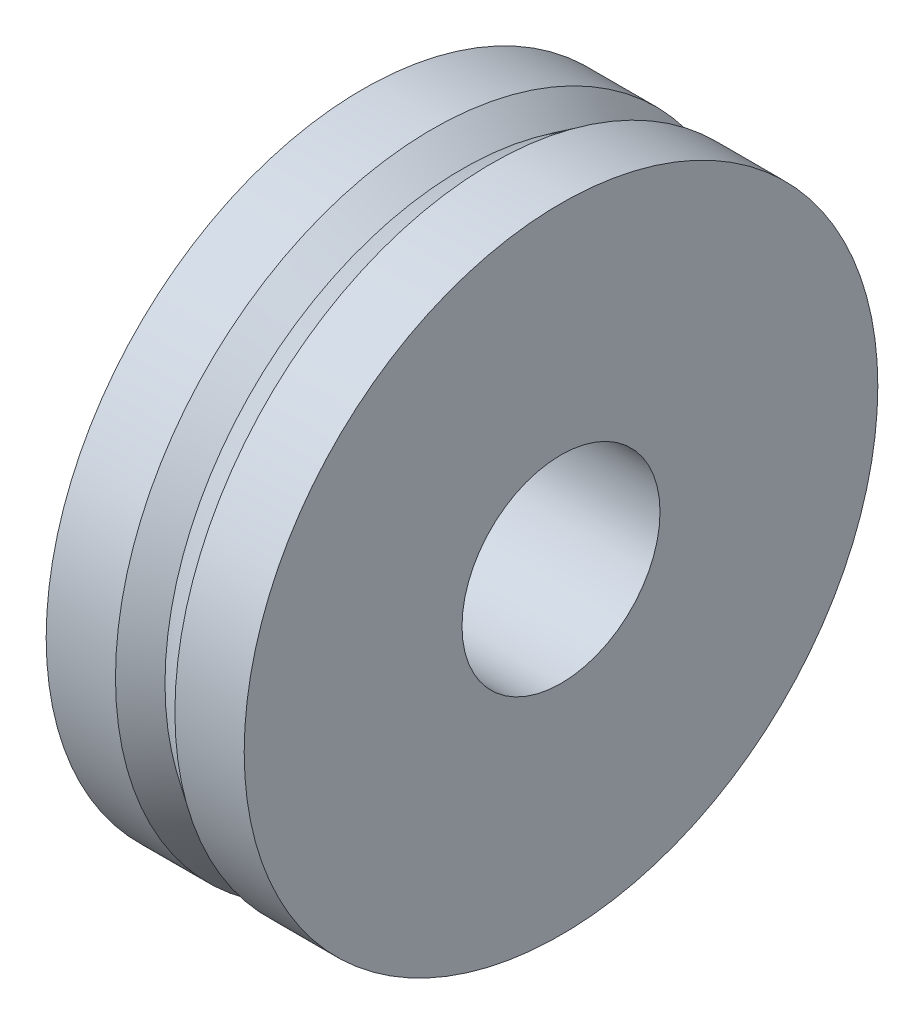
ISO-10303-21;
HEADER;
FILE_DESCRIPTION(('STEP AP214'),'2;1');
FILE_NAME('part.step','',(''),(''),'','','');
FILE_SCHEMA(('AUTOMOTIVE_DESIGN { 1 0 10303 214 1 1 1 1 }'));
ENDSEC;
DATA;
#1=APPLICATION_CONTEXT('core data for automotive mechanical design processes');
#2=APPLICATION_PROTOCOL_DEFINITION('international standard','automotive_design',2000,#1);
#3=PRODUCT_CONTEXT('',#1,'mechanical');
#4=PRODUCT('Part','Part','',(#3));
#5=PRODUCT_RELATED_PRODUCT_CATEGORY('part','',(#4));
#6=PRODUCT_DEFINITION_FORMATION('','',#4);
#7=PRODUCT_DEFINITION_CONTEXT('part definition',#1,'design');
#8=PRODUCT_DEFINITION('design','',#6,#7);
#9=PRODUCT_DEFINITION_SHAPE('','',#8);
#10=(LENGTH_UNIT() NAMED_UNIT(*) SI_UNIT(.MILLI.,.METRE.));
#11=(NAMED_UNIT(*) PLANE_ANGLE_UNIT() SI_UNIT($,.RADIAN.));
#12=(NAMED_UNIT(*) SI_UNIT($,.STERADIAN.) SOLID_ANGLE_UNIT());
#13=UNCERTAINTY_MEASURE_WITH_UNIT(LENGTH_MEASURE(1.E-05),#10,'distance_accuracy_value','');
#14=(GEOMETRIC_REPRESENTATION_CONTEXT(3) GLOBAL_UNCERTAINTY_ASSIGNED_CONTEXT((#13)) GLOBAL_UNIT_ASSIGNED_CONTEXT((#10,
#11,#12)) REPRESENTATION_CONTEXT('',''));
#15=CARTESIAN_POINT('',(0.,0.,0.));
#16=DIRECTION('',(0.,0.,1.));
#17=DIRECTION('',(1.,0.,0.));
#18=AXIS2_PLACEMENT_3D('',#15,#16,#17);
#19=CARTESIAN_POINT('',(5.,0.,0.));
#20=DIRECTION('',(-1.,0.,0.));
#21=DIRECTION('',(0.,0.,1.));
#22=AXIS2_PLACEMENT_3D('',#19,#20,#21);
#23=CYLINDRICAL_SURFACE('',#22,8.);
#24=CARTESIAN_POINT('',(0.,0.,0.));
#25=DIRECTION('',(1.,0.,0.));
#26=DIRECTION('',(0.,0.,-1.));
#27=AXIS2_PLACEMENT_3D('',#24,#25,#26);
#28=CIRCLE('',#27,8.);
#29=CARTESIAN_POINT('',(0.,0.,-8.));
#30=VERTEX_POINT('',#29);
#31=EDGE_CURVE('E35',#30,#30,#28,.T.);
#32=ORIENTED_EDGE('',*,*,#31,.T.);
#33=EDGE_LOOP('',(#32));
#34=FACE_BOUND('',#33,.T.);
#35=CARTESIAN_POINT('',(1.75,0.,0.));
#36=DIRECTION('',(-1.,0.,0.));
#37=DIRECTION('',(0.,0.,1.));
#38=AXIS2_PLACEMENT_3D('',#35,#36,#37);
#39=CIRCLE('',#38,8.);
#40=CARTESIAN_POINT('',(1.75,0.,8.));
#41=VERTEX_POINT('',#40);
#42=EDGE_CURVE('E47',#41,#41,#39,.T.);
#43=ORIENTED_EDGE('',*,*,#42,.T.);
#44=EDGE_LOOP('',(#43));
#45=FACE_BOUND('',#44,.T.);
#46=ADVANCED_FACE('F32',(#34,#45),#23,.T.);
#47=CARTESIAN_POINT('',(5.,0.,0.));
#48=DIRECTION('',(1.,0.,0.));
#49=DIRECTION('',(0.,0.,-1.));
#50=AXIS2_PLACEMENT_3D('',#47,#48,#49);
#51=CIRCLE('',#50,8.);
#52=CARTESIAN_POINT('',(5.,0.,-8.));
#53=VERTEX_POINT('',#52);
#54=EDGE_CURVE('E10',#53,#53,#51,.T.);
#55=ORIENTED_EDGE('',*,*,#54,.F.);
#56=EDGE_LOOP('',(#55));
#57=FACE_BOUND('',#56,.T.);
#58=CARTESIAN_POINT('',(3.25,0.,0.));
#59=DIRECTION('',(-1.,0.,0.));
#60=DIRECTION('',(0.,0.,1.));
#61=AXIS2_PLACEMENT_3D('',#58,#59,#60);
#62=CIRCLE('',#61,8.);
#63=CARTESIAN_POINT('',(3.25,0.,8.));
#64=VERTEX_POINT('',#63);
#65=EDGE_CURVE('E55',#64,#64,#62,.T.);
#66=ORIENTED_EDGE('',*,*,#65,.F.);
#67=EDGE_LOOP('',(#66));
#68=FACE_BOUND('',#67,.T.);
#69=ADVANCED_FACE('F62',(#57,#68),#23,.T.);
#70=CARTESIAN_POINT('',(5.,0.,0.));
#71=DIRECTION('',(1.,0.,0.));
#72=DIRECTION('',(0.,0.,-1.));
#73=AXIS2_PLACEMENT_3D('',#70,#71,#72);
#74=PLANE('',#73);
#75=ORIENTED_EDGE('',*,*,#54,.T.);
#76=EDGE_LOOP('',(#75));
#77=FACE_BOUND('',#76,.T.);
#78=CARTESIAN_POINT('',(5.,0.,0.));
#79=DIRECTION('',(1.,0.,0.));
#80=DIRECTION('',(0.,0.,-1.));
#81=AXIS2_PLACEMENT_3D('',#78,#79,#80);
#82=CIRCLE('',#81,2.5);
#83=CARTESIAN_POINT('',(5.,0.,-2.5));
#84=VERTEX_POINT('',#83);
#85=EDGE_CURVE('E42',#84,#84,#82,.T.);
#86=ORIENTED_EDGE('',*,*,#85,.F.);
#87=EDGE_LOOP('',(#86));
#88=FACE_BOUND('',#87,.T.);
#89=ADVANCED_FACE('F64',(#77,#88),#74,.T.);
#90=CARTESIAN_POINT('',(0.,0.,0.));
#91=DIRECTION('',(1.,0.,0.));
#92=DIRECTION('',(0.,0.,-1.));
#93=AXIS2_PLACEMENT_3D('',#90,#91,#92);
#94=PLANE('',#93);
#95=ORIENTED_EDGE('',*,*,#31,.F.);
#96=EDGE_LOOP('',(#95));
#97=FACE_BOUND('',#96,.T.);
#98=CARTESIAN_POINT('',(0.,0.,0.));
#99=DIRECTION('',(1.,0.,0.));
#100=DIRECTION('',(0.,0.,-1.));
#101=AXIS2_PLACEMENT_3D('',#98,#99,#100);
#102=CIRCLE('',#101,2.5);
#103=CARTESIAN_POINT('',(0.,0.,-2.5));
#104=VERTEX_POINT('',#103);
#105=EDGE_CURVE('E44',#104,#104,#102,.T.);
#106=ORIENTED_EDGE('',*,*,#105,.T.);
#107=EDGE_LOOP('',(#106));
#108=FACE_BOUND('',#107,.T.);
#109=ADVANCED_FACE('F70',(#97,#108),#94,.F.);
#110=CARTESIAN_POINT('',(5.,0.,0.));
#111=DIRECTION('',(-1.,0.,0.));
#112=DIRECTION('',(0.,0.,1.));
#113=AXIS2_PLACEMENT_3D('',#110,#111,#112);
#114=CYLINDRICAL_SURFACE('',#113,2.5);
#115=ORIENTED_EDGE('',*,*,#85,.T.);
#116=EDGE_LOOP('',(#115));
#117=FACE_BOUND('',#116,.T.);
#118=ORIENTED_EDGE('',*,*,#105,.F.);
#119=EDGE_LOOP('',(#118));
#120=FACE_BOUND('',#119,.T.);
#121=ADVANCED_FACE('F81',(#117,#120),#114,.F.);
#122=CARTESIAN_POINT('',(1.75,0.,0.));
#123=DIRECTION('',(-1.,0.,0.));
#124=DIRECTION('',(0.,0.,1.));
#125=AXIS2_PLACEMENT_3D('',#122,#123,#124);
#126=CONICAL_SURFACE('',#125,8.,0.588002603547568);
#127=CARTESIAN_POINT('',(2.5,0.,0.));
#128=DIRECTION('',(-1.,0.,0.));
#129=DIRECTION('',(0.,0.,1.));
#130=AXIS2_PLACEMENT_3D('',#127,#128,#129);
#131=CIRCLE('',#130,7.5);
#132=CARTESIAN_POINT('',(2.5,0.,7.5));
#133=VERTEX_POINT('',#132);
#134=EDGE_CURVE('E52',#133,#133,#131,.T.);
#135=ORIENTED_EDGE('',*,*,#134,.T.);
#136=EDGE_LOOP('',(#135));
#137=FACE_BOUND('',#136,.T.);
#138=ORIENTED_EDGE('',*,*,#42,.F.);
#139=EDGE_LOOP('',(#138));
#140=FACE_BOUND('',#139,.T.);
#141=ADVANCED_FACE('F79',(#137,#140),#126,.T.);
#142=CARTESIAN_POINT('',(2.5,0.,0.));
#143=DIRECTION('',(1.,0.,0.));
#144=DIRECTION('',(0.,0.,-1.));
#145=AXIS2_PLACEMENT_3D('',#142,#143,#144);
#146=CONICAL_SURFACE('',#145,7.5,0.588002603547568);
#147=ORIENTED_EDGE('',*,*,#65,.T.);
#148=EDGE_LOOP('',(#147));
#149=FACE_BOUND('',#148,.T.);
#150=ORIENTED_EDGE('',*,*,#134,.F.);
#151=EDGE_LOOP('',(#150));
#152=FACE_BOUND('',#151,.T.);
#153=ADVANCED_FACE('F59',(#149,#152),#146,.T.);
#154=CLOSED_SHELL('',(#46,#69,#89,#109,#121,#141,#153));
#155=MANIFOLD_SOLID_BREP('B2',#154);
#156=ADVANCED_BREP_SHAPE_REPRESENTATION('',(#18,#155),#14);
#157=SHAPE_DEFINITION_REPRESENTATION(#9,#156);
ENDSEC;
END-ISO-10303-21;
